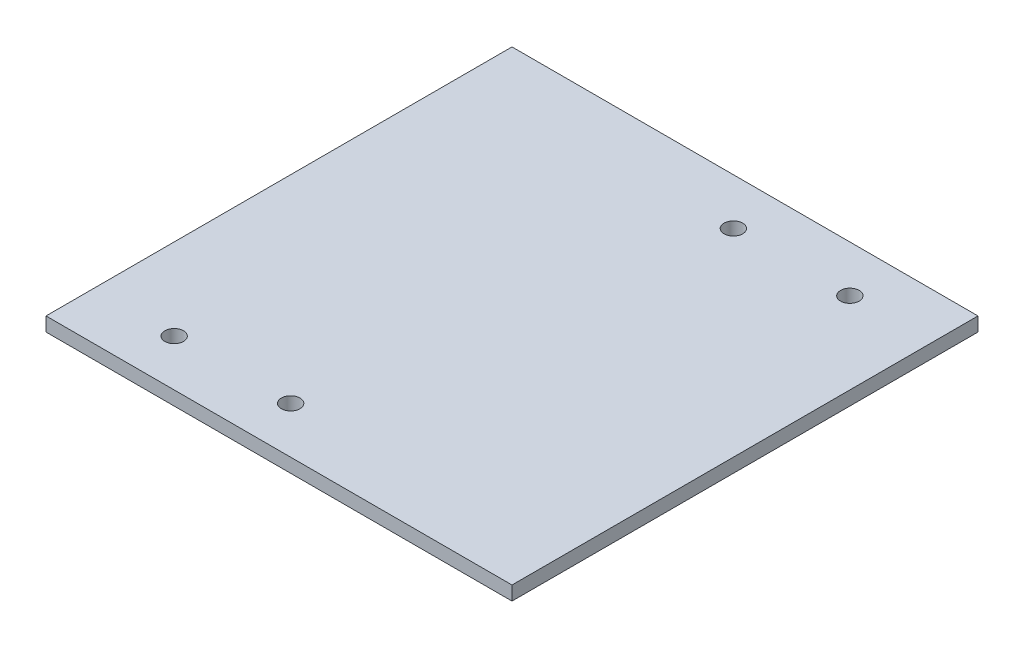
ISO-10303-21;
HEADER;
FILE_DESCRIPTION(('STEP AP214'),'2;1');
FILE_NAME('part.step','',(''),(''),'','','');
FILE_SCHEMA(('AUTOMOTIVE_DESIGN { 1 0 10303 214 1 1 1 1 }'));
ENDSEC;
DATA;
#1=APPLICATION_CONTEXT('core data for automotive mechanical design processes');
#2=APPLICATION_PROTOCOL_DEFINITION('international standard','automotive_design',2000,#1);
#3=PRODUCT_CONTEXT('',#1,'mechanical');
#4=PRODUCT('Part','Part','',(#3));
#5=PRODUCT_RELATED_PRODUCT_CATEGORY('part','',(#4));
#6=PRODUCT_DEFINITION_FORMATION('','',#4);
#7=PRODUCT_DEFINITION_CONTEXT('part definition',#1,'design');
#8=PRODUCT_DEFINITION('design','',#6,#7);
#9=PRODUCT_DEFINITION_SHAPE('','',#8);
#10=(LENGTH_UNIT() NAMED_UNIT(*) SI_UNIT(.MILLI.,.METRE.));
#11=(NAMED_UNIT(*) PLANE_ANGLE_UNIT() SI_UNIT($,.RADIAN.));
#12=(NAMED_UNIT(*) SI_UNIT($,.STERADIAN.) SOLID_ANGLE_UNIT());
#13=UNCERTAINTY_MEASURE_WITH_UNIT(LENGTH_MEASURE(1.E-05),#10,'distance_accuracy_value','');
#14=(GEOMETRIC_REPRESENTATION_CONTEXT(3) GLOBAL_UNCERTAINTY_ASSIGNED_CONTEXT((#13)) GLOBAL_UNIT_ASSIGNED_CONTEXT((#10,
#11,#12)) REPRESENTATION_CONTEXT('',''));
#15=CARTESIAN_POINT('',(0.,0.,0.));
#16=DIRECTION('',(0.,0.,1.));
#17=DIRECTION('',(1.,0.,0.));
#18=AXIS2_PLACEMENT_3D('',#15,#16,#17);
#19=CARTESIAN_POINT('',(50.,3.,-50.));
#20=DIRECTION('',(0.,-1.,0.));
#21=DIRECTION('',(0.,0.,-1.));
#22=AXIS2_PLACEMENT_3D('',#19,#20,#21);
#23=PLANE('',#22);
#24=CARTESIAN_POINT('',(7.50000000000002,3.,-40.));
#25=DIRECTION('',(0.,1.,0.));
#26=DIRECTION('',(0.,0.,1.));
#27=AXIS2_PLACEMENT_3D('',#24,#25,#26);
#28=CIRCLE('',#27,2.);
#29=CARTESIAN_POINT('',(7.50000000000002,3.,-38.));
#30=VERTEX_POINT('',#29);
#31=EDGE_CURVE('E119',#30,#30,#28,.T.);
#32=ORIENTED_EDGE('',*,*,#31,.F.);
#33=EDGE_LOOP('',(#32));
#34=FACE_BOUND('',#33,.T.);
#35=CARTESIAN_POINT('',(-32.5,3.,40.));
#36=DIRECTION('',(0.,1.,0.));
#37=DIRECTION('',(0.,0.,1.));
#38=AXIS2_PLACEMENT_3D('',#35,#36,#37);
#39=CIRCLE('',#38,2.);
#40=CARTESIAN_POINT('',(-32.5,3.,42.));
#41=VERTEX_POINT('',#40);
#42=EDGE_CURVE('E98',#41,#41,#39,.T.);
#43=ORIENTED_EDGE('',*,*,#42,.F.);
#44=EDGE_LOOP('',(#43));
#45=FACE_BOUND('',#44,.T.);
#46=DIRECTION('',(0.,0.,-1.));
#47=VECTOR('',#46,1.);
#48=CARTESIAN_POINT('',(50.,3.,50.));
#49=LINE('',#48,#47);
#50=CARTESIAN_POINT('',(50.,3.,50.));
#51=VERTEX_POINT('',#50);
#52=CARTESIAN_POINT('',(50.,3.,-50.));
#53=VERTEX_POINT('',#52);
#54=EDGE_CURVE('E83',#51,#53,#49,.T.);
#55=ORIENTED_EDGE('',*,*,#54,.T.);
#56=DIRECTION('',(-1.,0.,0.));
#57=VECTOR('',#56,1.);
#58=CARTESIAN_POINT('',(-50.,3.,-50.));
#59=LINE('',#58,#57);
#60=CARTESIAN_POINT('',(-50.,3.,-50.));
#61=VERTEX_POINT('',#60);
#62=EDGE_CURVE('E78',#53,#61,#59,.T.);
#63=ORIENTED_EDGE('',*,*,#62,.T.);
#64=DIRECTION('',(0.,0.,1.));
#65=VECTOR('',#64,1.);
#66=CARTESIAN_POINT('',(-50.,3.,50.));
#67=LINE('',#66,#65);
#68=CARTESIAN_POINT('',(-50.,3.,50.));
#69=VERTEX_POINT('',#68);
#70=EDGE_CURVE('E81',#61,#69,#67,.T.);
#71=ORIENTED_EDGE('',*,*,#70,.T.);
#72=DIRECTION('',(1.,0.,0.));
#73=VECTOR('',#72,1.);
#74=CARTESIAN_POINT('',(-50.,3.,50.));
#75=LINE('',#74,#73);
#76=EDGE_CURVE('E48',#69,#51,#75,.T.);
#77=ORIENTED_EDGE('',*,*,#76,.T.);
#78=EDGE_LOOP('',(#55,#63,#71,#77));
#79=FACE_BOUND('',#78,.T.);
#80=CARTESIAN_POINT('',(-7.49999999999998,3.,40.));
#81=DIRECTION('',(0.,1.,0.));
#82=DIRECTION('',(0.,0.,1.));
#83=AXIS2_PLACEMENT_3D('',#80,#81,#82);
#84=CIRCLE('',#83,2.);
#85=CARTESIAN_POINT('',(-7.49999999999998,3.,42.));
#86=VERTEX_POINT('',#85);
#87=EDGE_CURVE('E113',#86,#86,#84,.T.);
#88=ORIENTED_EDGE('',*,*,#87,.F.);
#89=EDGE_LOOP('',(#88));
#90=FACE_BOUND('',#89,.T.);
#91=CARTESIAN_POINT('',(32.5,3.,-40.));
#92=DIRECTION('',(0.,1.,0.));
#93=DIRECTION('',(0.,0.,1.));
#94=AXIS2_PLACEMENT_3D('',#91,#92,#93);
#95=CIRCLE('',#94,2.);
#96=CARTESIAN_POINT('',(32.5,3.,-38.));
#97=VERTEX_POINT('',#96);
#98=EDGE_CURVE('E125',#97,#97,#95,.T.);
#99=ORIENTED_EDGE('',*,*,#98,.F.);
#100=EDGE_LOOP('',(#99));
#101=FACE_BOUND('',#100,.T.);
#102=ADVANCED_FACE('F31',(#34,#45,#79,#90,#101),#23,.F.);
#103=CARTESIAN_POINT('',(50.,0.,-50.));
#104=DIRECTION('',(0.,-1.,0.));
#105=DIRECTION('',(0.,0.,-1.));
#106=AXIS2_PLACEMENT_3D('',#103,#104,#105);
#107=PLANE('',#106);
#108=CARTESIAN_POINT('',(7.50000000000002,0.,-40.));
#109=DIRECTION('',(0.,1.,0.));
#110=DIRECTION('',(0.,0.,1.));
#111=AXIS2_PLACEMENT_3D('',#108,#109,#110);
#112=CIRCLE('',#111,2.);
#113=CARTESIAN_POINT('',(7.50000000000002,0.,-38.));
#114=VERTEX_POINT('',#113);
#115=EDGE_CURVE('E122',#114,#114,#112,.T.);
#116=ORIENTED_EDGE('',*,*,#115,.T.);
#117=EDGE_LOOP('',(#116));
#118=FACE_BOUND('',#117,.T.);
#119=CARTESIAN_POINT('',(-32.5,0.,40.));
#120=DIRECTION('',(0.,1.,0.));
#121=DIRECTION('',(0.,0.,1.));
#122=AXIS2_PLACEMENT_3D('',#119,#120,#121);
#123=CIRCLE('',#122,2.);
#124=CARTESIAN_POINT('',(-32.5,0.,42.));
#125=VERTEX_POINT('',#124);
#126=EDGE_CURVE('E110',#125,#125,#123,.T.);
#127=ORIENTED_EDGE('',*,*,#126,.T.);
#128=EDGE_LOOP('',(#127));
#129=FACE_BOUND('',#128,.T.);
#130=DIRECTION('',(0.,0.,-1.));
#131=VECTOR('',#130,1.);
#132=CARTESIAN_POINT('',(50.,0.,50.));
#133=LINE('',#132,#131);
#134=CARTESIAN_POINT('',(50.,0.,50.));
#135=VERTEX_POINT('',#134);
#136=CARTESIAN_POINT('',(50.,0.,-50.));
#137=VERTEX_POINT('',#136);
#138=EDGE_CURVE('E95',#135,#137,#133,.T.);
#139=ORIENTED_EDGE('',*,*,#138,.F.);
#140=DIRECTION('',(1.,0.,0.));
#141=VECTOR('',#140,1.);
#142=CARTESIAN_POINT('',(-50.,0.,50.));
#143=LINE('',#142,#141);
#144=CARTESIAN_POINT('',(-50.,0.,50.));
#145=VERTEX_POINT('',#144);
#146=EDGE_CURVE('E71',#145,#135,#143,.T.);
#147=ORIENTED_EDGE('',*,*,#146,.F.);
#148=DIRECTION('',(0.,0.,1.));
#149=VECTOR('',#148,1.);
#150=CARTESIAN_POINT('',(-50.,0.,50.));
#151=LINE('',#150,#149);
#152=CARTESIAN_POINT('',(-50.,0.,-50.));
#153=VERTEX_POINT('',#152);
#154=EDGE_CURVE('E65',#153,#145,#151,.T.);
#155=ORIENTED_EDGE('',*,*,#154,.F.);
#156=DIRECTION('',(-1.,0.,0.));
#157=VECTOR('',#156,1.);
#158=CARTESIAN_POINT('',(-50.,0.,-50.));
#159=LINE('',#158,#157);
#160=EDGE_CURVE('E87',#137,#153,#159,.T.);
#161=ORIENTED_EDGE('',*,*,#160,.F.);
#162=EDGE_LOOP('',(#139,#147,#155,#161));
#163=FACE_BOUND('',#162,.T.);
#164=CARTESIAN_POINT('',(-7.49999999999998,0.,40.));
#165=DIRECTION('',(0.,1.,0.));
#166=DIRECTION('',(0.,0.,1.));
#167=AXIS2_PLACEMENT_3D('',#164,#165,#166);
#168=CIRCLE('',#167,2.);
#169=CARTESIAN_POINT('',(-7.49999999999998,0.,42.));
#170=VERTEX_POINT('',#169);
#171=EDGE_CURVE('E116',#170,#170,#168,.T.);
#172=ORIENTED_EDGE('',*,*,#171,.T.);
#173=EDGE_LOOP('',(#172));
#174=FACE_BOUND('',#173,.T.);
#175=CARTESIAN_POINT('',(32.5,0.,-40.));
#176=DIRECTION('',(0.,1.,0.));
#177=DIRECTION('',(0.,0.,1.));
#178=AXIS2_PLACEMENT_3D('',#175,#176,#177);
#179=CIRCLE('',#178,2.);
#180=CARTESIAN_POINT('',(32.5,0.,-38.));
#181=VERTEX_POINT('',#180);
#182=EDGE_CURVE('E128',#181,#181,#179,.T.);
#183=ORIENTED_EDGE('',*,*,#182,.T.);
#184=EDGE_LOOP('',(#183));
#185=FACE_BOUND('',#184,.T.);
#186=ADVANCED_FACE('F106',(#118,#129,#163,#174,#185),#107,.T.);
#187=CARTESIAN_POINT('',(50.,3.,50.));
#188=DIRECTION('',(-1.,0.,0.));
#189=DIRECTION('',(0.,0.,1.));
#190=AXIS2_PLACEMENT_3D('',#187,#188,#189);
#191=PLANE('',#190);
#192=ORIENTED_EDGE('',*,*,#138,.T.);
#193=DIRECTION('',(0.,-1.,0.));
#194=VECTOR('',#193,1.);
#195=CARTESIAN_POINT('',(50.,3.,-50.));
#196=LINE('',#195,#194);
#197=EDGE_CURVE('E11',#53,#137,#196,.T.);
#198=ORIENTED_EDGE('',*,*,#197,.F.);
#199=ORIENTED_EDGE('',*,*,#54,.F.);
#200=DIRECTION('',(0.,-1.,0.));
#201=VECTOR('',#200,1.);
#202=CARTESIAN_POINT('',(50.,3.,50.));
#203=LINE('',#202,#201);
#204=EDGE_CURVE('E91',#51,#135,#203,.T.);
#205=ORIENTED_EDGE('',*,*,#204,.T.);
#206=EDGE_LOOP('',(#192,#198,#199,#205));
#207=FACE_BOUND('',#206,.T.);
#208=ADVANCED_FACE('F33',(#207),#191,.F.);
#209=CARTESIAN_POINT('',(-50.,3.,-50.));
#210=DIRECTION('',(0.,0.,1.));
#211=DIRECTION('',(1.,0.,0.));
#212=AXIS2_PLACEMENT_3D('',#209,#210,#211);
#213=PLANE('',#212);
#214=ORIENTED_EDGE('',*,*,#160,.T.);
#215=DIRECTION('',(0.,-1.,0.));
#216=VECTOR('',#215,1.);
#217=CARTESIAN_POINT('',(-50.,3.,-50.));
#218=LINE('',#217,#216);
#219=EDGE_CURVE('E40',#61,#153,#218,.T.);
#220=ORIENTED_EDGE('',*,*,#219,.F.);
#221=ORIENTED_EDGE('',*,*,#62,.F.);
#222=ORIENTED_EDGE('',*,*,#197,.T.);
#223=EDGE_LOOP('',(#214,#220,#221,#222));
#224=FACE_BOUND('',#223,.T.);
#225=ADVANCED_FACE('F86',(#224),#213,.F.);
#226=CARTESIAN_POINT('',(-50.,3.,50.));
#227=DIRECTION('',(1.,0.,0.));
#228=DIRECTION('',(0.,0.,-1.));
#229=AXIS2_PLACEMENT_3D('',#226,#227,#228);
#230=PLANE('',#229);
#231=ORIENTED_EDGE('',*,*,#154,.T.);
#232=DIRECTION('',(0.,-1.,0.));
#233=VECTOR('',#232,1.);
#234=CARTESIAN_POINT('',(-50.,3.,50.));
#235=LINE('',#234,#233);
#236=EDGE_CURVE('E88',#69,#145,#235,.T.);
#237=ORIENTED_EDGE('',*,*,#236,.F.);
#238=ORIENTED_EDGE('',*,*,#70,.F.);
#239=ORIENTED_EDGE('',*,*,#219,.T.);
#240=EDGE_LOOP('',(#231,#237,#238,#239));
#241=FACE_BOUND('',#240,.T.);
#242=ADVANCED_FACE('F89',(#241),#230,.F.);
#243=CARTESIAN_POINT('',(-50.,3.,50.));
#244=DIRECTION('',(0.,0.,-1.));
#245=DIRECTION('',(-1.,0.,0.));
#246=AXIS2_PLACEMENT_3D('',#243,#244,#245);
#247=PLANE('',#246);
#248=ORIENTED_EDGE('',*,*,#146,.T.);
#249=ORIENTED_EDGE('',*,*,#204,.F.);
#250=ORIENTED_EDGE('',*,*,#76,.F.);
#251=ORIENTED_EDGE('',*,*,#236,.T.);
#252=EDGE_LOOP('',(#248,#249,#250,#251));
#253=FACE_BOUND('',#252,.T.);
#254=ADVANCED_FACE('F103',(#253),#247,.F.);
#255=CARTESIAN_POINT('',(-32.5,3.,40.));
#256=DIRECTION('',(0.,-1.,0.));
#257=DIRECTION('',(0.,0.,-1.));
#258=AXIS2_PLACEMENT_3D('',#255,#256,#257);
#259=CYLINDRICAL_SURFACE('',#258,2.);
#260=ORIENTED_EDGE('',*,*,#42,.T.);
#261=EDGE_LOOP('',(#260));
#262=FACE_BOUND('',#261,.T.);
#263=ORIENTED_EDGE('',*,*,#126,.F.);
#264=EDGE_LOOP('',(#263));
#265=FACE_BOUND('',#264,.T.);
#266=ADVANCED_FACE('F148',(#262,#265),#259,.F.);
#267=CARTESIAN_POINT('',(-7.49999999999998,3.,40.));
#268=DIRECTION('',(0.,-1.,0.));
#269=DIRECTION('',(0.,0.,-1.));
#270=AXIS2_PLACEMENT_3D('',#267,#268,#269);
#271=CYLINDRICAL_SURFACE('',#270,2.);
#272=ORIENTED_EDGE('',*,*,#87,.T.);
#273=EDGE_LOOP('',(#272));
#274=FACE_BOUND('',#273,.T.);
#275=ORIENTED_EDGE('',*,*,#171,.F.);
#276=EDGE_LOOP('',(#275));
#277=FACE_BOUND('',#276,.T.);
#278=ADVANCED_FACE('F194',(#274,#277),#271,.F.);
#279=CARTESIAN_POINT('',(7.50000000000002,3.,-40.));
#280=DIRECTION('',(0.,-1.,0.));
#281=DIRECTION('',(0.,0.,-1.));
#282=AXIS2_PLACEMENT_3D('',#279,#280,#281);
#283=CYLINDRICAL_SURFACE('',#282,2.);
#284=ORIENTED_EDGE('',*,*,#31,.T.);
#285=EDGE_LOOP('',(#284));
#286=FACE_BOUND('',#285,.T.);
#287=ORIENTED_EDGE('',*,*,#115,.F.);
#288=EDGE_LOOP('',(#287));
#289=FACE_BOUND('',#288,.T.);
#290=ADVANCED_FACE('F202',(#286,#289),#283,.F.);
#291=CARTESIAN_POINT('',(32.5,3.,-40.));
#292=DIRECTION('',(0.,-1.,0.));
#293=DIRECTION('',(0.,0.,-1.));
#294=AXIS2_PLACEMENT_3D('',#291,#292,#293);
#295=CYLINDRICAL_SURFACE('',#294,2.);
#296=ORIENTED_EDGE('',*,*,#98,.T.);
#297=EDGE_LOOP('',(#296));
#298=FACE_BOUND('',#297,.T.);
#299=ORIENTED_EDGE('',*,*,#182,.F.);
#300=EDGE_LOOP('',(#299));
#301=FACE_BOUND('',#300,.T.);
#302=ADVANCED_FACE('F134',(#298,#301),#295,.F.);
#303=CLOSED_SHELL('',(#102,#186,#208,#225,#242,#254,#266,#278,#290,#302));
#304=MANIFOLD_SOLID_BREP('B2',#303);
#305=ADVANCED_BREP_SHAPE_REPRESENTATION('',(#18,#304),#14);
#306=SHAPE_DEFINITION_REPRESENTATION(#9,#305);
ENDSEC;
END-ISO-10303-21;
